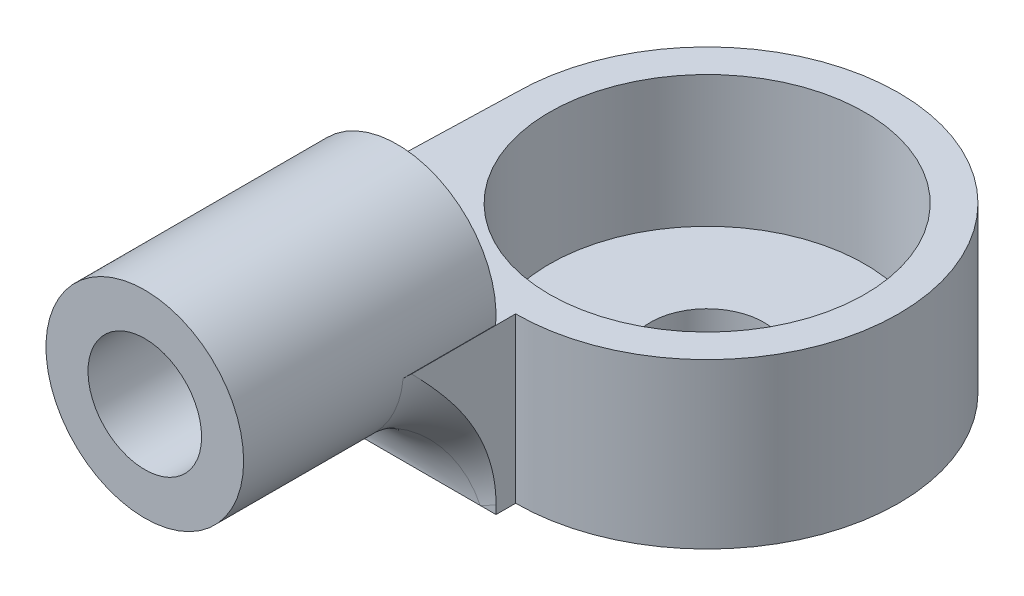
ISO-10303-21;
HEADER;
FILE_DESCRIPTION(('STEP AP214'),'2;1');
FILE_NAME('part.step','',(''),(''),'','','');
FILE_SCHEMA(('AUTOMOTIVE_DESIGN { 1 0 10303 214 1 1 1 1 }'));
ENDSEC;
DATA;
#1=APPLICATION_CONTEXT('core data for automotive mechanical design processes');
#2=APPLICATION_PROTOCOL_DEFINITION('international standard','automotive_design',2000,#1);
#3=PRODUCT_CONTEXT('',#1,'mechanical');
#4=PRODUCT('Part','Part','',(#3));
#5=PRODUCT_RELATED_PRODUCT_CATEGORY('part','',(#4));
#6=PRODUCT_DEFINITION_FORMATION('','',#4);
#7=PRODUCT_DEFINITION_CONTEXT('part definition',#1,'design');
#8=PRODUCT_DEFINITION('design','',#6,#7);
#9=PRODUCT_DEFINITION_SHAPE('','',#8);
#10=(LENGTH_UNIT() NAMED_UNIT(*) SI_UNIT(.MILLI.,.METRE.));
#11=(NAMED_UNIT(*) PLANE_ANGLE_UNIT() SI_UNIT($,.RADIAN.));
#12=(NAMED_UNIT(*) SI_UNIT($,.STERADIAN.) SOLID_ANGLE_UNIT());
#13=UNCERTAINTY_MEASURE_WITH_UNIT(LENGTH_MEASURE(1.E-05),#10,'distance_accuracy_value','');
#14=(GEOMETRIC_REPRESENTATION_CONTEXT(3) GLOBAL_UNCERTAINTY_ASSIGNED_CONTEXT((#13)) GLOBAL_UNIT_ASSIGNED_CONTEXT((#10,
#11,#12)) REPRESENTATION_CONTEXT('',''));
#15=CARTESIAN_POINT('',(0.,0.,0.));
#16=DIRECTION('',(0.,0.,1.));
#17=DIRECTION('',(1.,0.,0.));
#18=AXIS2_PLACEMENT_3D('',#15,#16,#17);
#19=CARTESIAN_POINT('',(0.,-5.207,0.));
#20=DIRECTION('',(0.,0.,1.));
#21=DIRECTION('',(1.,0.,0.));
#22=AXIS2_PLACEMENT_3D('',#19,#20,#21);
#23=PLANE('',#22);
#24=DIRECTION('',(0.,1.,0.));
#25=VECTOR('',#24,1.);
#26=CARTESIAN_POINT('',(2.9845,-5.207,0.));
#27=LINE('',#26,#25);
#28=CARTESIAN_POINT('',(2.9845,-5.207,0.));
#29=VERTEX_POINT('',#28);
#30=CARTESIAN_POINT('',(2.9845,-4.94811297364965,0.));
#31=VERTEX_POINT('',#30);
#32=EDGE_CURVE('E163',#29,#31,#27,.T.);
#33=ORIENTED_EDGE('',*,*,#32,.T.);
#34=CARTESIAN_POINT('',(0.,0.,0.));
#35=DIRECTION('',(0.,0.,1.));
#36=DIRECTION('',(1.,0.,0.));
#37=AXIS2_PLACEMENT_3D('',#34,#35,#36);
#38=CIRCLE('',#37,5.7785);
#39=CARTESIAN_POINT('',(2.50563629643251,-5.207,0.));
#40=VERTEX_POINT('',#39);
#41=EDGE_CURVE('E254',#31,#40,#38,.F.);
#42=ORIENTED_EDGE('',*,*,#41,.T.);
#43=DIRECTION('',(1.,0.,0.));
#44=VECTOR('',#43,1.);
#45=CARTESIAN_POINT('',(0.,-5.207,0.));
#46=LINE('',#45,#44);
#47=EDGE_CURVE('E278',#40,#29,#46,.T.);
#48=ORIENTED_EDGE('',*,*,#47,.T.);
#49=EDGE_LOOP('',(#33,#42,#48));
#50=FACE_BOUND('',#49,.T.);
#51=ADVANCED_FACE('F58',(#50),#23,.T.);
#52=CARTESIAN_POINT('',(-2.9845,-5.207,0.));
#53=VERTEX_POINT('',#52);
#54=CARTESIAN_POINT('',(-2.50563629643251,-5.207,0.));
#55=VERTEX_POINT('',#54);
#56=EDGE_CURVE('E166',#53,#55,#46,.T.);
#57=ORIENTED_EDGE('',*,*,#56,.T.);
#58=CARTESIAN_POINT('',(0.,0.,0.));
#59=DIRECTION('',(0.,0.,1.));
#60=DIRECTION('',(1.,0.,0.));
#61=AXIS2_PLACEMENT_3D('',#58,#59,#60);
#62=CIRCLE('',#61,5.7785);
#63=CARTESIAN_POINT('',(-2.9845,-4.94811297364965,0.));
#64=VERTEX_POINT('',#63);
#65=EDGE_CURVE('E287',#55,#64,#62,.F.);
#66=ORIENTED_EDGE('',*,*,#65,.T.);
#67=DIRECTION('',(0.,1.,0.));
#68=VECTOR('',#67,1.);
#69=CARTESIAN_POINT('',(-2.9845,-5.207,0.));
#70=LINE('',#69,#68);
#71=EDGE_CURVE('E160',#53,#64,#70,.T.);
#72=ORIENTED_EDGE('',*,*,#71,.F.);
#73=EDGE_LOOP('',(#57,#66,#72));
#74=FACE_BOUND('',#73,.T.);
#75=ADVANCED_FACE('F218',(#74),#23,.T.);
#76=CARTESIAN_POINT('',(2.9845,-5.207,0.));
#77=DIRECTION('',(1.,0.,0.));
#78=DIRECTION('',(0.,0.,-1.));
#79=AXIS2_PLACEMENT_3D('',#76,#77,#78);
#80=PLANE('',#79);
#81=DIRECTION('',(0.,1.,0.));
#82=VECTOR('',#81,1.);
#83=CARTESIAN_POINT('',(2.9845,-5.207,-0.591184928107953));
#84=LINE('',#83,#82);
#85=CARTESIAN_POINT('',(2.9845,-5.207,-0.591184928107953));
#86=VERTEX_POINT('',#85);
#87=CARTESIAN_POINT('',(2.9845,-0.254,-0.591184928107953));
#88=VERTEX_POINT('',#87);
#89=EDGE_CURVE('E280',#86,#88,#84,.T.);
#90=ORIENTED_EDGE('',*,*,#89,.T.);
#91=DIRECTION('',(0.,0.,-1.));
#92=VECTOR('',#91,1.);
#93=CARTESIAN_POINT('',(2.9845,-0.254,0.));
#94=LINE('',#93,#92);
#95=CARTESIAN_POINT('',(2.9845,-0.254,2.54869899723182));
#96=VERTEX_POINT('',#95);
#97=EDGE_CURVE('E142',#96,#88,#94,.T.);
#98=ORIENTED_EDGE('',*,*,#97,.F.);
#99=CARTESIAN_POINT('',(2.9845,-0.254,2.54869899723182));
#100=CARTESIAN_POINT('',(2.9845,-0.430318222904969,2.3790572530662));
#101=CARTESIAN_POINT('',(2.9845,-0.60776957446443,2.21030063636479));
#102=CARTESIAN_POINT('',(2.9845,-0.969580406075679,1.87838707611917));
#103=CARTESIAN_POINT('',(2.9845,-1.15397239282188,1.71526585522995));
#104=CARTESIAN_POINT('',(2.9845,-1.53809880233424,1.39572054228169));
#105=CARTESIAN_POINT('',(2.9845,-1.73812676159396,1.23964118247874));
#106=CARTESIAN_POINT('',(2.9845,-2.15085029880881,0.94610515116868));
#107=CARTESIAN_POINT('',(2.9845,-2.36351439316778,0.808604777161214));
#108=CARTESIAN_POINT('',(2.9845,-2.82068684809301,0.549016396344919));
#109=CARTESIAN_POINT('',(2.9845,-3.06638576242602,0.428950761343581));
#110=CARTESIAN_POINT('',(2.9845,-3.44521956833531,0.278744138159547));
#111=CARTESIAN_POINT('',(2.9845,-3.57255514881397,0.233807423939295));
#112=CARTESIAN_POINT('',(2.9845,-3.83050611917862,0.154742457003558));
#113=CARTESIAN_POINT('',(2.9845,-3.96111975801134,0.12060856097015));
#114=CARTESIAN_POINT('',(2.9845,-4.23291055162498,0.0626611679452059));
#115=CARTESIAN_POINT('',(2.9845,-4.37424995905213,0.0395935602629943));
#116=CARTESIAN_POINT('',(2.9845,-4.65970771418172,0.00818805372576478));
#117=CARTESIAN_POINT('',(2.9845,-4.80383934265432,-2.76046053152052E-05));
#118=CARTESIAN_POINT('',(2.9845,-4.94811297364965,0.));
#119=B_SPLINE_CURVE_WITH_KNOTS('',3,(#99,#100,#101,#102,#103,#104,#105,#106,#107,#108,#109,#110,
#111,#112,#113,#114,#115,#116,#117,#118),.UNSPECIFIED.,.F.,.F.,(4,2,2,2,2,2,2,2,2,4),(0.,
0.734347752721539,1.4727166371307,2.23310238701329,2.99166716459109,3.80906308265623,
4.21376585064471,4.6182568543865,5.04712340382969,5.47950398622193),.UNSPECIFIED.);
#120=EDGE_CURVE('E253',#96,#31,#119,.T.);
#121=ORIENTED_EDGE('',*,*,#120,.T.);
#122=ORIENTED_EDGE('',*,*,#32,.F.);
#123=DIRECTION('',(0.,0.,-1.));
#124=VECTOR('',#123,1.);
#125=CARTESIAN_POINT('',(2.9845,-5.207,0.));
#126=LINE('',#125,#124);
#127=EDGE_CURVE('E161',#29,#86,#126,.T.);
#128=ORIENTED_EDGE('',*,*,#127,.T.);
#129=EDGE_LOOP('',(#90,#98,#121,#122,#128));
#130=FACE_BOUND('',#129,.T.);
#131=ADVANCED_FACE('F259',(#130),#80,.T.);
#132=CARTESIAN_POINT('',(0.,0.,0.));
#133=DIRECTION('',(0.,0.,1.));
#134=DIRECTION('',(1.,0.,0.));
#135=AXIS2_PLACEMENT_3D('',#132,#133,#134);
#136=CIRCLE('',#135,1.7145);
#137=CARTESIAN_POINT('',(-1.69558080019797,-0.254,0.));
#138=VERTEX_POINT('',#137);
#139=CARTESIAN_POINT('',(1.69558080019797,-0.254,0.));
#140=VERTEX_POINT('',#139);
#141=EDGE_CURVE('E178',#138,#140,#136,.T.);
#142=ORIENTED_EDGE('',*,*,#141,.T.);
#143=DIRECTION('',(1.,0.,0.));
#144=VECTOR('',#143,1.);
#145=CARTESIAN_POINT('',(1.7145,-0.254,0.));
#146=LINE('',#145,#144);
#147=EDGE_CURVE('E299',#138,#140,#146,.T.);
#148=ORIENTED_EDGE('',*,*,#147,.F.);
#149=EDGE_LOOP('',(#142,#148));
#150=FACE_BOUND('',#149,.T.);
#151=ADVANCED_FACE('F262',(#150),#23,.T.);
#152=CARTESIAN_POINT('',(-2.98194799166882,-5.207,-0.087235062434181));
#153=DIRECTION('',(0.999572364866461,0.,0.0292418774238273));
#154=DIRECTION('',(0.0292418774238273,0.,-0.999572364866461));
#155=AXIS2_PLACEMENT_3D('',#152,#153,#154);
#156=PLANE('',#155);
#157=DIRECTION('',(-0.0292418774238273,0.,0.999572364866461));
#158=VECTOR('',#157,1.);
#159=CARTESIAN_POINT('',(-2.79804056382586,-0.254,-6.37372549193381));
#160=LINE('',#159,#158);
#161=CARTESIAN_POINT('',(-2.79804056382586,-0.254,-6.37372549193381));
#162=VERTEX_POINT('',#161);
#163=CARTESIAN_POINT('',(-3.04759229379741,-0.254,2.15667798622748));
#164=VERTEX_POINT('',#163);
#165=EDGE_CURVE('E85',#162,#164,#160,.T.);
#166=ORIENTED_EDGE('',*,*,#165,.F.);
#167=DIRECTION('',(0.,1.,0.));
#168=VECTOR('',#167,1.);
#169=CARTESIAN_POINT('',(-2.79804056382586,-5.207,-6.37372549193381));
#170=LINE('',#169,#168);
#171=CARTESIAN_POINT('',(-2.79804056382586,-5.207,-6.37372549193381));
#172=VERTEX_POINT('',#171);
#173=EDGE_CURVE('E150',#172,#162,#170,.T.);
#174=ORIENTED_EDGE('',*,*,#173,.F.);
#175=DIRECTION('',(0.0292418774238273,0.,-0.999572364866461));
#176=VECTOR('',#175,1.);
#177=CARTESIAN_POINT('',(-2.98194799166882,-5.207,-0.087235062434181));
#178=LINE('',#177,#176);
#179=EDGE_CURVE('E171',#53,#172,#178,.T.);
#180=ORIENTED_EDGE('',*,*,#179,.F.);
#181=ORIENTED_EDGE('',*,*,#71,.T.);
#182=CARTESIAN_POINT('',(-2.9845,-4.94811297364965,0.));
#183=CARTESIAN_POINT('',(-2.98449955425545,-4.82777556473345,-1.52368444692248E-05));
#184=CARTESIAN_POINT('',(-2.98466668492363,-4.70751365074747,0.00569777517647074));
#185=CARTESIAN_POINT('',(-2.98531082633912,-4.46811834815513,0.0277164010210256));
#186=CARTESIAN_POINT('',(-2.98578741406452,-4.34898364389792,0.0440075547265178));
#187=CARTESIAN_POINT('',(-2.987009766202,-4.11546121567862,0.0857911036774603));
#188=CARTESIAN_POINT('',(-2.9877484600515,-4.00102945763951,0.111041806542914));
#189=CARTESIAN_POINT('',(-2.98947165613891,-3.77434622770025,0.169945657457064));
#190=CARTESIAN_POINT('',(-2.99045621545065,-3.66209526856853,0.203600756455081));
#191=CARTESIAN_POINT('',(-2.9932357657411,-3.38038382744148,0.298613864431209));
#192=CARTESIAN_POINT('',(-2.99518170796752,-3.21265698495198,0.365131825811033));
#193=CARTESIAN_POINT('',(-2.99950378661477,-2.88383931253286,0.512873036539459));
#194=CARTESIAN_POINT('',(-3.00188014857497,-2.72275201629984,0.594103995479175));
#195=CARTESIAN_POINT('',(-3.00700718226996,-2.40478234052347,0.769360909424024));
#196=CARTESIAN_POINT('',(-3.00976269592263,-2.24799232103126,0.86355237525567));
#197=CARTESIAN_POINT('',(-3.01552599702926,-1.93998823469284,1.06055875870702));
#198=CARTESIAN_POINT('',(-3.01853381930247,-1.78877494160839,1.16337486654971));
#199=CARTESIAN_POINT('',(-3.02277833407795,-1.58266084492655,1.30846471869374));
#200=CARTESIAN_POINT('',(-3.02395470278073,-1.52627594409493,1.34867642019134));
#201=CARTESIAN_POINT('',(-3.02631966130461,-1.41381837076519,1.42951757653235));
#202=CARTESIAN_POINT('',(-3.02750824923111,-1.35774565188108,1.47014696661299));
#203=CARTESIAN_POINT('',(-3.02988658906248,-1.24576591123852,1.55144553493804));
#204=CARTESIAN_POINT('',(-3.03107633614547,-1.18985876769552,1.59211454835676));
#205=CARTESIAN_POINT('',(-3.03344701465878,-1.07777878207935,1.67315123056232));
#206=CARTESIAN_POINT('',(-3.03462794109778,-1.02160581520135,1.71351872873135));
#207=CARTESIAN_POINT('',(-3.03694417862315,-0.909444639356197,1.79269445973074));
#208=CARTESIAN_POINT('',(-3.0380799104175,-0.853466631072503,1.83151707358274));
#209=CARTESIAN_POINT('',(-3.0402953820753,-0.740323469582461,1.90724833434227));
#210=CARTESIAN_POINT('',(-3.04137520461429,-0.683160255124149,1.94415980734007));
#211=CARTESIAN_POINT('',(-3.04292035737836,-0.595595318412219,1.99697761996134));
#212=CARTESIAN_POINT('',(-3.04342454027378,-0.566001439580052,2.0142120567859));
#213=CARTESIAN_POINT('',(-3.04439584943658,-0.506131506572582,2.04741422718035));
#214=CARTESIAN_POINT('',(-3.04486299954396,-0.475855907645572,2.06338277567047));
#215=CARTESIAN_POINT('',(-3.04574975178236,-0.414276207488221,2.09369454461536));
#216=CARTESIAN_POINT('',(-3.04616908080169,-0.382967398858573,2.10802842931873));
#217=CARTESIAN_POINT('',(-3.04693826163965,-0.319291344303678,2.13432126606347));
#218=CARTESIAN_POINT('',(-3.04728795048195,-0.286921817302516,2.14627464709987));
#219=CARTESIAN_POINT('',(-3.04759229379741,-0.253999999999986,2.15667798622746));
#220=B_SPLINE_CURVE_WITH_KNOTS('',3,(#182,#183,#184,#185,#186,#187,#188,#189,#190,#191,#192,
#193,#194,#195,#196,#197,#198,#199,#200,#201,#202,#203,#204,#205,#206,#207,#208,#209,#210,#211,
#212,#213,#214,#215,#216,#217,#218,#219),.UNSPECIFIED.,.F.,.F.,(4,2,2,2,2,2,2,2,2,2,2,2,2,2,2,2,
2,2,4),(0.,0.360766410694746,0.721040695867765,1.07225492285105,1.42355075464335,
1.96396521870022,2.50466368278902,3.05305044403314,3.60151300897115,3.80930892298928,
4.01707309003728,4.22450833151554,4.43205320120639,4.63643919430471,4.84051377450327,
4.94324157999144,5.04590270778876,5.14912353315589,5.25258315479688),.UNSPECIFIED.);
#221=EDGE_CURVE('E72',#64,#164,#220,.T.);
#222=ORIENTED_EDGE('',*,*,#221,.T.);
#223=EDGE_LOOP('',(#166,#174,#180,#181,#222));
#224=FACE_BOUND('',#223,.T.);
#225=ADVANCED_FACE('F148',(#224),#156,.F.);
#226=CARTESIAN_POINT('',(2.9845,-5.207,-6.37372549193381));
#227=DIRECTION('',(0.,1.,0.));
#228=DIRECTION('',(0.,0.,1.));
#229=AXIS2_PLACEMENT_3D('',#226,#227,#228);
#230=CYLINDRICAL_SURFACE('',#229,5.78254056382586);
#231=ORIENTED_EDGE('',*,*,#173,.T.);
#232=CARTESIAN_POINT('',(2.9845,-0.254,-6.37372549193381));
#233=DIRECTION('',(0.,1.,0.));
#234=DIRECTION('',(0.,0.,1.));
#235=AXIS2_PLACEMENT_3D('',#232,#233,#234);
#236=CIRCLE('',#235,5.78254056382586);
#237=EDGE_CURVE('E139',#88,#162,#236,.T.);
#238=ORIENTED_EDGE('',*,*,#237,.F.);
#239=ORIENTED_EDGE('',*,*,#89,.F.);
#240=CARTESIAN_POINT('',(2.9845,-5.207,-6.37372549193381));
#241=DIRECTION('',(0.,1.,0.));
#242=DIRECTION('',(0.,0.,1.));
#243=AXIS2_PLACEMENT_3D('',#240,#241,#242);
#244=CIRCLE('',#243,5.78254056382586);
#245=EDGE_CURVE('E155',#86,#172,#244,.T.);
#246=ORIENTED_EDGE('',*,*,#245,.T.);
#247=EDGE_LOOP('',(#231,#238,#239,#246));
#248=FACE_BOUND('',#247,.T.);
#249=ADVANCED_FACE('F157',(#248),#230,.T.);
#250=CARTESIAN_POINT('',(0.,0.,0.));
#251=DIRECTION('',(0.,0.,1.));
#252=DIRECTION('',(1.,0.,0.));
#253=AXIS2_PLACEMENT_3D('',#250,#251,#252);
#254=PLANE('',#253);
#255=EDGE_CURVE('E176',#140,#138,#136,.T.);
#256=ORIENTED_EDGE('',*,*,#255,.T.);
#257=CARTESIAN_POINT('',(-2.9736718463879,-0.254,0.));
#258=VERTEX_POINT('',#257);
#259=EDGE_CURVE('E303',#258,#138,#146,.T.);
#260=ORIENTED_EDGE('',*,*,#259,.F.);
#261=CARTESIAN_POINT('',(0.,0.,0.));
#262=DIRECTION('',(0.,0.,1.));
#263=DIRECTION('',(1.,0.,0.));
#264=AXIS2_PLACEMENT_3D('',#261,#262,#263);
#265=CIRCLE('',#264,2.9845);
#266=CARTESIAN_POINT('',(2.9736718463879,-0.254,0.));
#267=VERTEX_POINT('',#266);
#268=EDGE_CURVE('E175',#267,#258,#265,.T.);
#269=ORIENTED_EDGE('',*,*,#268,.F.);
#270=EDGE_CURVE('E186',#140,#267,#146,.T.);
#271=ORIENTED_EDGE('',*,*,#270,.F.);
#272=EDGE_LOOP('',(#256,#260,#269,#271));
#273=FACE_BOUND('',#272,.T.);
#274=ADVANCED_FACE('F314',(#273),#254,.F.);
#275=CARTESIAN_POINT('',(0.,0.,7.62));
#276=DIRECTION('',(0.,0.,1.));
#277=DIRECTION('',(1.,0.,0.));
#278=AXIS2_PLACEMENT_3D('',#275,#276,#277);
#279=PLANE('',#278);
#280=CARTESIAN_POINT('',(0.,0.,7.62));
#281=DIRECTION('',(0.,0.,1.));
#282=DIRECTION('',(1.,0.,0.));
#283=AXIS2_PLACEMENT_3D('',#280,#281,#282);
#284=CIRCLE('',#283,2.9845);
#285=CARTESIAN_POINT('',(2.9845,0.,7.62));
#286=VERTEX_POINT('',#285);
#287=EDGE_CURVE('E179',#286,#286,#284,.T.);
#288=ORIENTED_EDGE('',*,*,#287,.T.);
#289=EDGE_LOOP('',(#288));
#290=FACE_BOUND('',#289,.T.);
#291=CARTESIAN_POINT('',(0.,0.,7.62));
#292=DIRECTION('',(0.,0.,1.));
#293=DIRECTION('',(1.,0.,0.));
#294=AXIS2_PLACEMENT_3D('',#291,#292,#293);
#295=CIRCLE('',#294,1.7145);
#296=CARTESIAN_POINT('',(1.7145,0.,7.62));
#297=VERTEX_POINT('',#296);
#298=EDGE_CURVE('E172',#297,#297,#295,.T.);
#299=ORIENTED_EDGE('',*,*,#298,.F.);
#300=EDGE_LOOP('',(#299));
#301=FACE_BOUND('',#300,.T.);
#302=ADVANCED_FACE('F386',(#290,#301),#279,.T.);
#303=CARTESIAN_POINT('',(0.,0.,7.62));
#304=DIRECTION('',(0.,0.,-1.));
#305=DIRECTION('',(-1.,0.,0.));
#306=AXIS2_PLACEMENT_3D('',#303,#304,#305);
#307=CYLINDRICAL_SURFACE('',#306,2.9845);
#308=ORIENTED_EDGE('',*,*,#287,.F.);
#309=EDGE_LOOP('',(#308));
#310=FACE_BOUND('',#309,.T.);
#311=CARTESIAN_POINT('',(0.,0.,2.794));
#312=DIRECTION('',(0.,0.,1.));
#313=DIRECTION('',(1.,0.,0.));
#314=AXIS2_PLACEMENT_3D('',#311,#312,#313);
#315=CIRCLE('',#314,2.9845);
#316=CARTESIAN_POINT('',(1.2941198454102,-2.68932967032967,2.794));
#317=VERTEX_POINT('',#316);
#318=CARTESIAN_POINT('',(2.9736718463879,-0.254,2.794));
#319=VERTEX_POINT('',#318);
#320=EDGE_CURVE('E199',#317,#319,#315,.T.);
#321=ORIENTED_EDGE('',*,*,#320,.T.);
#322=DIRECTION('',(0.,0.,-1.));
#323=VECTOR('',#322,1.);
#324=CARTESIAN_POINT('',(2.9736718463879,-0.254,2.794));
#325=LINE('',#324,#323);
#326=EDGE_CURVE('E288',#319,#267,#325,.T.);
#327=ORIENTED_EDGE('',*,*,#326,.T.);
#328=ORIENTED_EDGE('',*,*,#268,.T.);
#329=DIRECTION('',(0.,0.,-1.));
#330=VECTOR('',#329,1.);
#331=CARTESIAN_POINT('',(-2.9736718463879,-0.254,0.));
#332=LINE('',#331,#330);
#333=CARTESIAN_POINT('',(-2.9736718463879,-0.254,2.794));
#334=VERTEX_POINT('',#333);
#335=EDGE_CURVE('E79',#258,#334,#332,.F.);
#336=ORIENTED_EDGE('',*,*,#335,.T.);
#337=CARTESIAN_POINT('',(0.,0.,2.794));
#338=DIRECTION('',(0.,0.,1.));
#339=DIRECTION('',(1.,0.,0.));
#340=AXIS2_PLACEMENT_3D('',#337,#338,#339);
#341=CIRCLE('',#340,2.9845);
#342=CARTESIAN_POINT('',(-1.2941198454102,-2.68932967032967,2.794));
#343=VERTEX_POINT('',#342);
#344=EDGE_CURVE('E189',#334,#343,#341,.T.);
#345=ORIENTED_EDGE('',*,*,#344,.T.);
#346=CARTESIAN_POINT('',(-1.6321146193025,-2.49868807966482,2.76951086562846));
#347=CARTESIAN_POINT('',(-1.44210040170448,-2.622803204294,-0.344416300621451));
#348=CARTESIAN_POINT('',(-3.16005170971336,-5.207,0.));
#349=CARTESIAN_POINT('',(-1.56804061491643,-2.54055618130868,2.7802589443057));
#350=CARTESIAN_POINT('',(-1.4292452787796,-2.62458879006487,-0.267885084776662));
#351=CARTESIAN_POINT('',(-3.03599353101207,-5.207,0.));
#352=CARTESIAN_POINT('',(-1.5022595694909,-2.57999187401074,2.78687114016735));
#353=CARTESIAN_POINT('',(-1.40589800705343,-2.63498360887899,-0.19557060503634));
#354=CARTESIAN_POINT('',(-2.90863023029482,-5.207,0.));
#355=CARTESIAN_POINT('',(-1.36785099738968,-2.65369004043594,2.79407419495292));
#356=CARTESIAN_POINT('',(-1.34115290095876,-2.66623178604618,-0.0630738542115051));
#357=CARTESIAN_POINT('',(-2.64839235665047,-5.207,0.));
#358=CARTESIAN_POINT('',(-1.29922630545342,-2.68795751522585,2.79467091210701));
#359=CARTESIAN_POINT('',(-1.30011332207921,-2.68687171325272,-0.00248624660090672));
#360=CARTESIAN_POINT('',(-2.5155232722614,-5.207,0.));
#361=CARTESIAN_POINT('',(-1.15959985509926,-2.75108053451763,2.79210611922381));
#362=CARTESIAN_POINT('',(-1.20273559083183,-2.73225153368091,0.105922848069147));
#363=CARTESIAN_POINT('',(-2.24518269817038,-5.207,0.));
#364=CARTESIAN_POINT('',(-1.0885990811538,-2.77993828847626,2.78894614739484));
#365=CARTESIAN_POINT('',(-1.14657586924249,-2.75696825278081,0.154135635606158));
#366=CARTESIAN_POINT('',(-2.10771311457463,-5.207,0.));
#367=CARTESIAN_POINT('',(-0.944598557725389,-2.83210842914756,2.78075317723828));
#368=CARTESIAN_POINT('',(-1.02213667040134,-2.80595047718256,0.238711177476796));
#369=CARTESIAN_POINT('',(-1.82890359049016,-5.207,0.));
#370=CARTESIAN_POINT('',(-0.871598292986927,-2.85541937120277,2.77571969183075));
#371=CARTESIAN_POINT('',(-0.953863990206374,-2.83029656815707,0.275389599642209));
#372=CARTESIAN_POINT('',(-1.68756265237907,-5.207,0.));
#373=CARTESIAN_POINT('',(-0.722103514890692,-2.89689142899284,2.76525144662944));
#374=CARTESIAN_POINT('',(-0.806304263833505,-2.87586329075429,0.33883129700941));
#375=CARTESIAN_POINT('',(-1.39811531606483,-5.207,0.));
#376=CARTESIAN_POINT('',(-0.64556751298448,-2.91490260451463,2.75980965006469));
#377=CARTESIAN_POINT('',(-0.726619842141191,-2.89712326900344,0.365578291321165));
#378=CARTESIAN_POINT('',(-1.24992858897004,-5.207,0.));
#379=CARTESIAN_POINT('',(-0.49129522761557,-2.94483323501312,2.75001361212619));
#380=CARTESIAN_POINT('',(-0.560694493893803,-2.93340370604846,0.409031717501616));
#381=CARTESIAN_POINT('',(-0.951231185383516,-5.207,0.));
#382=CARTESIAN_POINT('',(-0.41355896145908,-2.9567527777387,2.7456593550871));
#383=CARTESIAN_POINT('',(-0.474208713686,-2.9485498417913,0.425912811368466));
#384=CARTESIAN_POINT('',(-0.800720542399544,-5.207,0.));
#385=CARTESIAN_POINT('',(-0.257395619199188,-2.9744175074679,2.73898901467628));
#386=CARTESIAN_POINT('',(-0.297627972457571,-2.97120083673001,0.450588423393133));
#387=CARTESIAN_POINT('',(-0.498361730789868,-5.207,0.));
#388=CARTESIAN_POINT('',(-0.178968844646248,-2.98016526682157,2.73667208223691));
#389=CARTESIAN_POINT('',(-0.207215717683651,-2.97879480177104,0.458484564987176));
#390=CARTESIAN_POINT('',(-0.346514146017186,-5.207,0.));
#391=CARTESIAN_POINT('',(-0.0218951727990886,-2.98545411816401,2.73454488020291));
#392=CARTESIAN_POINT('',(-0.0255650510352713,-2.98574923688591,0.465727505673954));
#393=CARTESIAN_POINT('',(-0.0423927813769769,-5.207,0.));
#394=CARTESIAN_POINT('',(0.0567517313886112,-2.9849950135572,2.73473469000659));
#395=CARTESIAN_POINT('',(0.0660283209981212,-2.98513684417593,0.465102525614897));
#396=CARTESIAN_POINT('',(0.109881011837503,-5.207,0.));
#397=CARTESIAN_POINT('',(0.218227352249302,-2.97766944823885,2.73766758631635));
#398=CARTESIAN_POINT('',(0.252452579153523,-2.97552071356632,0.455053948694904));
#399=CARTESIAN_POINT('',(0.422525299035905,-5.207,0.));
#400=CARTESIAN_POINT('',(0.301039060067988,-2.9704394613866,2.74055551262067));
#401=CARTESIAN_POINT('',(0.347562613668331,-2.96599882187169,0.445087064449779));
#402=CARTESIAN_POINT('',(0.582862860982771,-5.207,0.));
#403=CARTESIAN_POINT('',(0.465748444241967,-2.94910426455949,2.74843560737338));
#404=CARTESIAN_POINT('',(0.532354335830877,-2.93887995859169,0.415089207910617));
#405=CARTESIAN_POINT('',(0.901768264383406,-5.207,0.));
#406=CARTESIAN_POINT('',(0.547646046626109,-2.934998502251,2.75342794486557));
#407=CARTESIAN_POINT('',(0.622398116582167,-2.92116879574525,0.39492413323468));
#408=CARTESIAN_POINT('',(1.06033596261643,-5.207,0.));
#409=CARTESIAN_POINT('',(0.709969131768196,-2.9000134997226,2.76427417587285));
#410=CARTESIAN_POINT('',(0.793784820924421,-2.87964184557905,0.343486876969167));
#411=CARTESIAN_POINT('',(1.37462108491296,-5.207,0.));
#412=CARTESIAN_POINT('',(0.790394520252827,-2.87913382732669,2.77012812434578));
#413=CARTESIAN_POINT('',(0.875385885737528,-2.85567097775461,0.311982657168038));
#414=CARTESIAN_POINT('',(1.53033832644728,-5.207,0.));
#415=CARTESIAN_POINT('',(0.949237355922241,-2.83073849485605,2.78095266502867));
#416=CARTESIAN_POINT('',(1.02650123473129,-2.80472942031329,0.236551844192751));
#417=CARTESIAN_POINT('',(1.83788509338149,-5.207,0.));
#418=CARTESIAN_POINT('',(1.0276549928885,-2.80322346456518,2.78592334099525));
#419=CARTESIAN_POINT('',(1.096122487485,-2.77761339420692,0.192286772788721));
#420=CARTESIAN_POINT('',(1.98971498623062,-5.207,0.));
#421=CARTESIAN_POINT('',(1.16944756748122,-2.74672088728869,2.79223552396739));
#422=CARTESIAN_POINT('',(1.20958037642476,-2.72930102395611,0.0985950940762013));
#423=CARTESIAN_POINT('',(2.26424954554899,-5.207,0.));
#424=CARTESIAN_POINT('',(1.23320112745554,-2.71869429556429,2.79403456482013));
#425=CARTESIAN_POINT('',(1.25585677795467,-2.70775541325028,0.0507592950611369));
#426=CARTESIAN_POINT('',(2.38768728932984,-5.207,0.));
#427=CARTESIAN_POINT('',(1.35856886895192,-2.65826481584469,2.79396446648972));
#428=CARTESIAN_POINT('',(1.33537499533101,-2.6694634779367,-0.0547212426362361));
#429=CARTESIAN_POINT('',(2.63042057605482,-5.207,0.));
#430=CARTESIAN_POINT('',(1.42018409758806,-2.62586410892327,2.79209714922481));
#431=CARTESIAN_POINT('',(1.36845490372528,-2.65276745834758,-0.112658554493954));
#432=CARTESIAN_POINT('',(2.74971814639005,-5.207,0.));
#433=CARTESIAN_POINT('',(1.54102875818855,-2.55681660705905,2.78300493790753));
#434=CARTESIAN_POINT('',(1.41961537425039,-2.6288981577403,-0.237967724369596));
#435=CARTESIAN_POINT('',(2.98369397862425,-5.207,0.));
#436=CARTESIAN_POINT('',(1.60025427188582,-2.52016319238498,2.77577159413916));
#437=CARTESIAN_POINT('',(1.43738322557674,-2.62192974701474,-0.305652179448812));
#438=CARTESIAN_POINT('',(3.0983646540912,-5.207,0.));
#439=CARTESIAN_POINT('',(1.71584507523722,-2.44294533117182,2.75400231962545));
#440=CARTESIAN_POINT('',(1.45673408563252,-2.62329140891876,-0.448051052839484));
#441=CARTESIAN_POINT('',(3.32216812441852,-5.207,0.));
#442=CARTESIAN_POINT('',(1.77220579907833,-2.40237492284997,2.73945511074574));
#443=CARTESIAN_POINT('',(1.45791389694456,-2.63200941540636,-0.522992915067539));
#444=CARTESIAN_POINT('',(3.4312920790877,-5.207,0.));
#445=CARTESIAN_POINT('',(1.82685578824405,-2.36005046110443,2.72029005580399));
#446=CARTESIAN_POINT('',(1.45031752856504,-2.65151927099929,-0.598915069756094));
#447=CARTESIAN_POINT('',(3.5371037602172,-5.207,0.));
#448=(BOUNDED_SURFACE() B_SPLINE_SURFACE(3,2,((#346,#347,#348),(#349,#350,#351),(#352,#353,
#354),(#355,#356,#357),(#358,#359,#360),(#361,#362,#363),(#364,#365,#366),(#367,#368,#369),
(#370,#371,#372),(#373,#374,#375),(#376,#377,#378),(#379,#380,#381),(#382,#383,#384),(#385,#386,
#387),(#388,#389,#390),(#391,#392,#393),(#394,#395,#396),(#397,#398,#399),(#400,#401,#402),
(#403,#404,#405),(#406,#407,#408),(#409,#410,#411),(#412,#413,#414),(#415,#416,#417),(#418,#419,
#420),(#421,#422,#423),(#424,#425,#426),(#427,#428,#429),(#430,#431,#432),(#433,#434,#435),
(#436,#437,#438),(#439,#440,#441),(#442,#443,#444),(#445,#446,#447)),.UNSPECIFIED.,.F.,.F.,
.F.) B_SPLINE_SURFACE_WITH_KNOTS((4,2,2,2,2,2,2,2,2,2,2,2,2,2,2,2,4),(3,3),(0.,
0.445432206474789,0.890430582677227,1.33524681324025,1.78017876891542,2.23669899100391,
2.69321263681599,3.14953593744199,3.60587369163981,4.0882082267595,4.57058151438041,
5.05298558350909,5.53534388407323,5.93954606592169,6.34354743897606,6.74818633447144,
7.15345111425337),(0.,1.),
.UNSPECIFIED.) GEOMETRIC_REPRESENTATION_ITEM() RATIONAL_B_SPLINE_SURFACE(((1.,0.666856384805919,
1.),(1.,0.675277219628775,1.),(1.,0.683489591734213,1.),(1.,0.699228993214745,1.),(1.,
0.706756682291679,1.),(1.,0.720872828283355,1.),(1.,0.727461668381097,1.),(1.,0.739528352943609,
1.),(1.,0.745005907921488,1.),(1.,0.754837760294834,1.),(1.,0.759159086747689,1.),(1.,
0.766380541796276,1.),(1.,0.769280690863787,1.),(1.,0.773589795352233,1.),(1.,0.774999372028115,
1.),(1.,0.776296171370533,1.),(1.,0.776183345816654,1.),(1.,0.774387833629431,1.),(1.,
0.772616080859369,1.),(1.,0.767420740565907,1.),(1.,0.763997020339566,1.),(1.,0.755589080043159,
1.),(1.,0.750604760407438,1.),(1.,0.739213355224213,1.),(1.,0.732806404707903,1.),(1.,
0.719901885817777,1.),(1.,0.713587204763922,1.),(1.,0.700251062906536,1.),(1.,0.693229954791743,
1.),(1.,0.678660119466763,1.),(1.,0.671110577146442,1.),(1.,0.65575105512545,1.),(1.,
0.647940690649739,1.),(1.,0.640140880537609,1.))) REPRESENTATION_ITEM('') SURFACE());
#449=CARTESIAN_POINT('',(-1.6321146193025,-2.49868807966482,2.76951086562846));
#450=CARTESIAN_POINT('',(-1.56804061491643,-2.54055618130868,2.7802589443057));
#451=CARTESIAN_POINT('',(-1.5022595694909,-2.57999187401074,2.78687114016735));
#452=CARTESIAN_POINT('',(-1.36785099738968,-2.65369004043594,2.79407419495292));
#453=CARTESIAN_POINT('',(-1.29922630545342,-2.68795751522585,2.79467091210701));
#454=CARTESIAN_POINT('',(-1.15959985509926,-2.75108053451763,2.79210611922381));
#455=CARTESIAN_POINT('',(-1.0885990811538,-2.77993828847626,2.78894614739484));
#456=CARTESIAN_POINT('',(-0.944598557725389,-2.83210842914756,2.78075317723828));
#457=CARTESIAN_POINT('',(-0.871598292986927,-2.85541937120277,2.77571969183075));
#458=CARTESIAN_POINT('',(-0.722103514890692,-2.89689142899284,2.76525144662944));
#459=CARTESIAN_POINT('',(-0.64556751298448,-2.91490260451463,2.75980965006469));
#460=CARTESIAN_POINT('',(-0.49129522761557,-2.94483323501312,2.75001361212619));
#461=CARTESIAN_POINT('',(-0.41355896145908,-2.9567527777387,2.7456593550871));
#462=CARTESIAN_POINT('',(-0.257395619199188,-2.9744175074679,2.73898901467628));
#463=CARTESIAN_POINT('',(-0.178968844646248,-2.98016526682157,2.73667208223691));
#464=CARTESIAN_POINT('',(-0.0218951727990886,-2.98545411816401,2.73454488020291));
#465=CARTESIAN_POINT('',(0.0567517313886112,-2.9849950135572,2.73473469000659));
#466=CARTESIAN_POINT('',(0.218227352249302,-2.97766944823885,2.73766758631635));
#467=CARTESIAN_POINT('',(0.301039060067988,-2.9704394613866,2.74055551262067));
#468=CARTESIAN_POINT('',(0.465748444241967,-2.94910426455949,2.74843560737338));
#469=CARTESIAN_POINT('',(0.547646046626109,-2.93499850225101,2.75342794486557));
#470=CARTESIAN_POINT('',(0.709969131768196,-2.9000134997226,2.76427417587285));
#471=CARTESIAN_POINT('',(0.790394520252827,-2.87913382732669,2.77012812434578));
#472=CARTESIAN_POINT('',(0.949237355922241,-2.83073849485605,2.78095266502867));
#473=CARTESIAN_POINT('',(1.0276549928885,-2.80322346456518,2.78592334099525));
#474=CARTESIAN_POINT('',(1.16944756748122,-2.74672088728869,2.79223552396739));
#475=CARTESIAN_POINT('',(1.23320112745554,-2.71869429556429,2.79403456482013));
#476=CARTESIAN_POINT('',(1.35856886895192,-2.65826481584469,2.79396446648972));
#477=CARTESIAN_POINT('',(1.42018409758806,-2.62586410892327,2.7920971492248));
#478=CARTESIAN_POINT('',(1.54102875818855,-2.55681660705905,2.78300493790753));
#479=CARTESIAN_POINT('',(1.60025427188582,-2.52016319238498,2.77577159413916));
#480=CARTESIAN_POINT('',(1.71584507523722,-2.44294533117182,2.75400231962545));
#481=CARTESIAN_POINT('',(1.77220579907833,-2.40237492284997,2.73945511074574));
#482=CARTESIAN_POINT('',(1.82685578824405,-2.36005046110443,2.72029005580399));
#483=B_SPLINE_CURVE_WITH_KNOTS('',3,(#449,#450,#451,#452,#453,#454,#455,#456,#457,#458,#459,
#460,#461,#462,#463,#464,#465,#466,#467,#468,#469,#470,#471,#472,#473,#474,#475,#476,#477,#478,
#479,#480,#481,#482),.UNSPECIFIED.,.F.,.F.,(4,2,2,2,2,2,2,2,2,2,2,2,2,2,2,2,4),(0.,
0.445432206474789,0.890430582677227,1.33524681324025,1.78017876891542,2.23669899100391,
2.69321263681599,3.14953593744199,3.60587369163981,4.0882082267595,4.57058151438041,
5.05298558350909,5.53534388407323,5.93954606592169,6.34354743897606,6.74818633447144,
7.15345111425337),.UNSPECIFIED.);
#484=EDGE_CURVE('E192',#343,#317,#483,.T.);
#485=ORIENTED_EDGE('',*,*,#484,.T.);
#486=EDGE_LOOP('',(#321,#327,#328,#336,#345,#485));
#487=FACE_BOUND('',#486,.T.);
#488=ADVANCED_FACE('F201',(#310,#487),#307,.T.);
#489=CARTESIAN_POINT('',(0.,0.,7.62));
#490=DIRECTION('',(0.,0.,-1.));
#491=DIRECTION('',(-1.,0.,0.));
#492=AXIS2_PLACEMENT_3D('',#489,#490,#491);
#493=CYLINDRICAL_SURFACE('',#492,1.7145);
#494=ORIENTED_EDGE('',*,*,#298,.T.);
#495=EDGE_LOOP('',(#494));
#496=FACE_BOUND('',#495,.T.);
#497=ORIENTED_EDGE('',*,*,#255,.F.);
#498=ORIENTED_EDGE('',*,*,#141,.F.);
#499=EDGE_LOOP('',(#497,#498));
#500=FACE_BOUND('',#499,.T.);
#501=ADVANCED_FACE('F313',(#496,#500),#493,.F.);
#502=CARTESIAN_POINT('',(0.,-5.207,0.));
#503=DIRECTION('',(0.,1.,0.));
#504=DIRECTION('',(0.,0.,1.));
#505=AXIS2_PLACEMENT_3D('',#502,#503,#504);
#506=PLANE('',#505);
#507=CARTESIAN_POINT('',(2.9845,-5.207,-6.37372549193381));
#508=DIRECTION('',(0.,1.,0.));
#509=DIRECTION('',(0.,0.,1.));
#510=AXIS2_PLACEMENT_3D('',#507,#508,#509);
#511=CIRCLE('',#510,1.7145);
#512=CARTESIAN_POINT('',(2.9845,-5.207,-4.65922549193381));
#513=VERTEX_POINT('',#512);
#514=EDGE_CURVE('E231',#513,#513,#511,.F.);
#515=ORIENTED_EDGE('',*,*,#514,.F.);
#516=EDGE_LOOP('',(#515));
#517=FACE_BOUND('',#516,.T.);
#518=ORIENTED_EDGE('',*,*,#179,.T.);
#519=ORIENTED_EDGE('',*,*,#245,.F.);
#520=ORIENTED_EDGE('',*,*,#127,.F.);
#521=ORIENTED_EDGE('',*,*,#47,.F.);
#522=EDGE_CURVE('E309',#55,#40,#46,.T.);
#523=ORIENTED_EDGE('',*,*,#522,.F.);
#524=ORIENTED_EDGE('',*,*,#56,.F.);
#525=EDGE_LOOP('',(#518,#519,#520,#521,#523,#524));
#526=FACE_BOUND('',#525,.T.);
#527=ADVANCED_FACE('F222',(#517,#526),#506,.F.);
#528=CARTESIAN_POINT('',(2.9845,-0.254,-6.37372549193381));
#529=DIRECTION('',(0.,1.,0.));
#530=DIRECTION('',(0.,0.,1.));
#531=AXIS2_PLACEMENT_3D('',#528,#529,#530);
#532=PLANE('',#531);
#533=CARTESIAN_POINT('',(2.9845,-0.254,-6.37372549193381));
#534=DIRECTION('',(0.,1.,0.));
#535=DIRECTION('',(0.,0.,1.));
#536=AXIS2_PLACEMENT_3D('',#533,#534,#535);
#537=CIRCLE('',#536,4.7625);
#538=CARTESIAN_POINT('',(2.9845,-0.254,-1.61122549193381));
#539=VERTEX_POINT('',#538);
#540=EDGE_CURVE('E183',#539,#539,#537,.T.);
#541=ORIENTED_EDGE('',*,*,#540,.F.);
#542=EDGE_LOOP('',(#541));
#543=FACE_BOUND('',#542,.T.);
#544=ORIENTED_EDGE('',*,*,#165,.T.);
#545=CARTESIAN_POINT('',(-3.04759229379741,-0.254,2.15667798622748));
#546=CARTESIAN_POINT('',(-3.02299496389539,-0.254,2.26147433259518));
#547=CARTESIAN_POINT('',(-3.0045362616601,-0.254,2.366982673986));
#548=CARTESIAN_POINT('',(-2.9798961127027,-0.254,2.57942334526428));
#549=CARTESIAN_POINT('',(-2.97371466580149,-0.254,2.68635567513096));
#550=CARTESIAN_POINT('',(-2.9736718463879,-0.254,2.794));
#551=B_SPLINE_CURVE_WITH_KNOTS('',3,(#545,#546,#547,#548,#549,#550),.UNSPECIFIED.,.F.,.F.,(4,2,
4),(0.,0.32133254444777,0.642665084207741),.UNSPECIFIED.);
#552=EDGE_CURVE('E12',#164,#334,#551,.T.);
#553=ORIENTED_EDGE('',*,*,#552,.T.);
#554=ORIENTED_EDGE('',*,*,#335,.F.);
#555=ORIENTED_EDGE('',*,*,#259,.T.);
#556=ORIENTED_EDGE('',*,*,#147,.T.);
#557=ORIENTED_EDGE('',*,*,#270,.T.);
#558=ORIENTED_EDGE('',*,*,#326,.F.);
#559=CARTESIAN_POINT('',(2.9736718463879,-0.254,2.794));
#560=CARTESIAN_POINT('',(2.97367276138786,-0.254,2.75303687663907));
#561=CARTESIAN_POINT('',(2.97457556502215,-0.254,2.7121135647284));
#562=CARTESIAN_POINT('',(2.97818494955943,-0.254,2.63034656380567));
#563=CARTESIAN_POINT('',(2.98089153046251,-0.254,2.58950287479361));
#564=CARTESIAN_POINT('',(2.9845,-0.254,2.54869899723182));
#565=B_SPLINE_CURVE_WITH_KNOTS('',3,(#559,#560,#561,#562,#563,#564),.UNSPECIFIED.,.F.,.F.,(4,2,
4),(0.,0.122799807040796,0.245599614087431),.UNSPECIFIED.);
#566=EDGE_CURVE('E248',#319,#96,#565,.T.);
#567=ORIENTED_EDGE('',*,*,#566,.T.);
#568=ORIENTED_EDGE('',*,*,#97,.T.);
#569=ORIENTED_EDGE('',*,*,#237,.T.);
#570=EDGE_LOOP('',(#544,#553,#554,#555,#556,#557,#558,#567,#568,#569));
#571=FACE_BOUND('',#570,.T.);
#572=ADVANCED_FACE('F140',(#543,#571),#532,.T.);
#573=CARTESIAN_POINT('',(2.9845,-4.22275,-6.37372549193381));
#574=DIRECTION('',(0.,1.,0.));
#575=DIRECTION('',(0.,0.,1.));
#576=AXIS2_PLACEMENT_3D('',#573,#574,#575);
#577=CYLINDRICAL_SURFACE('',#576,4.7625);
#578=ORIENTED_EDGE('',*,*,#540,.T.);
#579=EDGE_LOOP('',(#578));
#580=FACE_BOUND('',#579,.T.);
#581=CARTESIAN_POINT('',(2.9845,-4.22275,-6.37372549193381));
#582=DIRECTION('',(0.,1.,0.));
#583=DIRECTION('',(0.,0.,1.));
#584=AXIS2_PLACEMENT_3D('',#581,#582,#583);
#585=CIRCLE('',#584,4.7625);
#586=CARTESIAN_POINT('',(2.9845,-4.22275,-1.61122549193381));
#587=VERTEX_POINT('',#586);
#588=EDGE_CURVE('E187',#587,#587,#585,.T.);
#589=ORIENTED_EDGE('',*,*,#588,.F.);
#590=EDGE_LOOP('',(#589));
#591=FACE_BOUND('',#590,.T.);
#592=ADVANCED_FACE('F243',(#580,#591),#577,.F.);
#593=CARTESIAN_POINT('',(0.,-4.22275,0.));
#594=DIRECTION('',(0.,1.,0.));
#595=DIRECTION('',(0.,0.,1.));
#596=AXIS2_PLACEMENT_3D('',#593,#594,#595);
#597=PLANE('',#596);
#598=CARTESIAN_POINT('',(2.9845,-4.22275,-6.37372549193381));
#599=DIRECTION('',(0.,1.,0.));
#600=DIRECTION('',(0.,0.,1.));
#601=AXIS2_PLACEMENT_3D('',#598,#599,#600);
#602=CIRCLE('',#601,1.7145);
#603=CARTESIAN_POINT('',(2.9845,-4.22275,-4.65922549193381));
#604=VERTEX_POINT('',#603);
#605=EDGE_CURVE('E330',#604,#604,#602,.T.);
#606=ORIENTED_EDGE('',*,*,#605,.F.);
#607=EDGE_LOOP('',(#606));
#608=FACE_BOUND('',#607,.T.);
#609=ORIENTED_EDGE('',*,*,#588,.T.);
#610=EDGE_LOOP('',(#609));
#611=FACE_BOUND('',#610,.T.);
#612=ADVANCED_FACE('F337',(#608,#611),#597,.T.);
#613=CARTESIAN_POINT('',(0.,0.,2.794));
#614=DIRECTION('',(0.,0.,1.));
#615=DIRECTION('',(1.,0.,0.));
#616=AXIS2_PLACEMENT_3D('',#613,#614,#615);
#617=TOROIDAL_SURFACE('',#616,5.7785,2.794);
#618=ORIENTED_EDGE('',*,*,#566,.F.);
#619=ORIENTED_EDGE('',*,*,#320,.F.);
#620=CARTESIAN_POINT('',(2.50563629643251,-5.207,2.794));
#621=DIRECTION('',(0.901098901098901,0.433613618834041,0.));
#622=DIRECTION('',(-0.433613618834041,0.901098901098901,0.));
#623=AXIS2_PLACEMENT_3D('',#620,#621,#622);
#624=CIRCLE('',#623,2.794);
#625=EDGE_CURVE('E227',#40,#317,#624,.T.);
#626=ORIENTED_EDGE('',*,*,#625,.F.);
#627=ORIENTED_EDGE('',*,*,#41,.F.);
#628=ORIENTED_EDGE('',*,*,#120,.F.);
#629=EDGE_LOOP('',(#618,#619,#626,#627,#628));
#630=FACE_BOUND('',#629,.T.);
#631=ADVANCED_FACE('F60',(#630),#617,.F.);
#632=ORIENTED_EDGE('',*,*,#625,.T.);
#633=ORIENTED_EDGE('',*,*,#484,.F.);
#634=CARTESIAN_POINT('',(-2.50563629643249,-5.20700000000001,2.794));
#635=DIRECTION('',(-0.901098901098902,0.433613618834038,0.));
#636=DIRECTION('',(-0.433613618834038,-0.901098901098902,0.));
#637=AXIS2_PLACEMENT_3D('',#634,#635,#636);
#638=CIRCLE('',#637,2.794);
#639=EDGE_CURVE('E230',#55,#343,#638,.F.);
#640=ORIENTED_EDGE('',*,*,#639,.F.);
#641=ORIENTED_EDGE('',*,*,#522,.T.);
#642=EDGE_LOOP('',(#632,#633,#640,#641));
#643=FACE_BOUND('',#642,.T.);
#644=ADVANCED_FACE('F209',(#643),#448,.F.);
#645=CARTESIAN_POINT('',(0.,0.,2.794));
#646=DIRECTION('',(0.,0.,1.));
#647=DIRECTION('',(1.,0.,0.));
#648=AXIS2_PLACEMENT_3D('',#645,#646,#647);
#649=TOROIDAL_SURFACE('',#648,5.7785,2.794);
#650=ORIENTED_EDGE('',*,*,#221,.F.);
#651=ORIENTED_EDGE('',*,*,#65,.F.);
#652=ORIENTED_EDGE('',*,*,#639,.T.);
#653=ORIENTED_EDGE('',*,*,#344,.F.);
#654=ORIENTED_EDGE('',*,*,#552,.F.);
#655=EDGE_LOOP('',(#650,#651,#652,#653,#654));
#656=FACE_BOUND('',#655,.T.);
#657=ADVANCED_FACE('F207',(#656),#649,.F.);
#658=CARTESIAN_POINT('',(2.9845,-10.0563383053773,-6.37372549193381));
#659=DIRECTION('',(0.,1.,0.));
#660=DIRECTION('',(0.,0.,1.));
#661=AXIS2_PLACEMENT_3D('',#658,#659,#660);
#662=CYLINDRICAL_SURFACE('',#661,1.7145);
#663=ORIENTED_EDGE('',*,*,#514,.T.);
#664=EDGE_LOOP('',(#663));
#665=FACE_BOUND('',#664,.T.);
#666=ORIENTED_EDGE('',*,*,#605,.T.);
#667=EDGE_LOOP('',(#666));
#668=FACE_BOUND('',#667,.T.);
#669=ADVANCED_FACE('F351',(#665,#668),#662,.F.);
#670=CLOSED_SHELL('',(#51,#75,#131,#151,#225,#249,#274,#302,#488,#501,#527,#572,#592,#612,#631,
#644,#657,#669));
#671=MANIFOLD_SOLID_BREP('B2',#670);
#672=ADVANCED_BREP_SHAPE_REPRESENTATION('',(#18,#671),#14);
#673=SHAPE_DEFINITION_REPRESENTATION(#9,#672);
ENDSEC;
END-ISO-10303-21;
